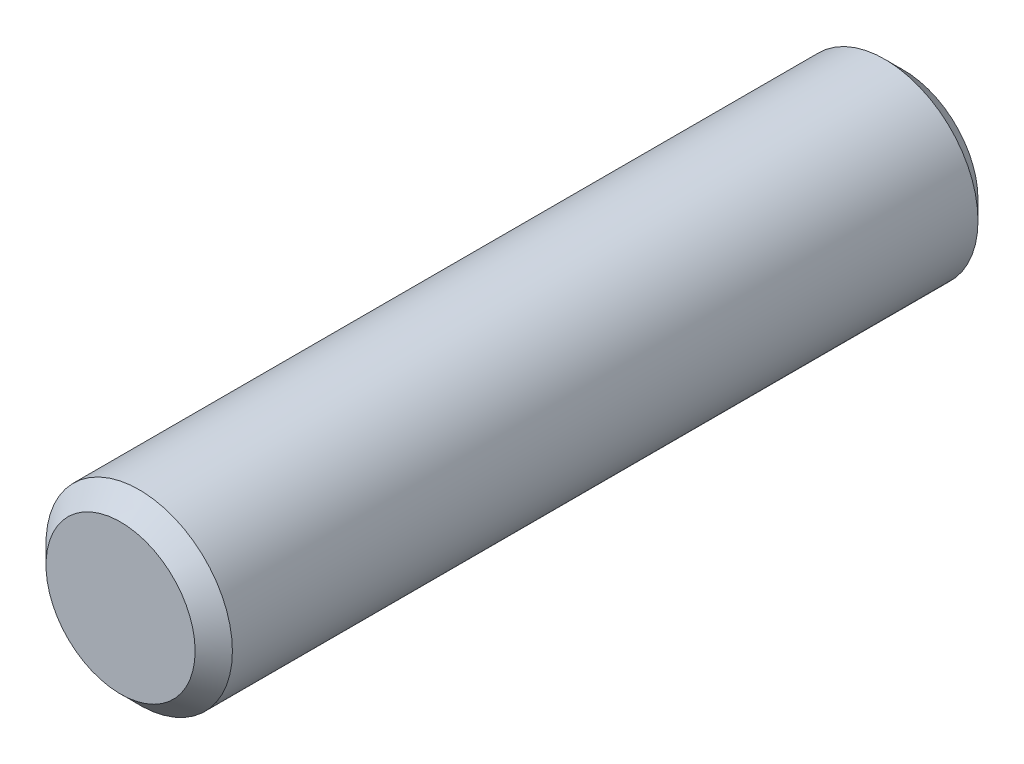
ISO-10303-21;
HEADER;
FILE_DESCRIPTION(('STEP AP214'),'2;1');
FILE_NAME('part.step','',(''),(''),'','','');
FILE_SCHEMA(('AUTOMOTIVE_DESIGN { 1 0 10303 214 1 1 1 1 }'));
ENDSEC;
DATA;
#1=APPLICATION_CONTEXT('core data for automotive mechanical design processes');
#2=APPLICATION_PROTOCOL_DEFINITION('international standard','automotive_design',2000,#1);
#3=PRODUCT_CONTEXT('',#1,'mechanical');
#4=PRODUCT('Part','Part','',(#3));
#5=PRODUCT_RELATED_PRODUCT_CATEGORY('part','',(#4));
#6=PRODUCT_DEFINITION_FORMATION('','',#4);
#7=PRODUCT_DEFINITION_CONTEXT('part definition',#1,'design');
#8=PRODUCT_DEFINITION('design','',#6,#7);
#9=PRODUCT_DEFINITION_SHAPE('','',#8);
#10=(LENGTH_UNIT() NAMED_UNIT(*) SI_UNIT(.MILLI.,.METRE.));
#11=(NAMED_UNIT(*) PLANE_ANGLE_UNIT() SI_UNIT($,.RADIAN.));
#12=(NAMED_UNIT(*) SI_UNIT($,.STERADIAN.) SOLID_ANGLE_UNIT());
#13=UNCERTAINTY_MEASURE_WITH_UNIT(LENGTH_MEASURE(1.E-05),#10,'distance_accuracy_value','');
#14=(GEOMETRIC_REPRESENTATION_CONTEXT(3) GLOBAL_UNCERTAINTY_ASSIGNED_CONTEXT((#13)) GLOBAL_UNIT_ASSIGNED_CONTEXT((#10,
#11,#12)) REPRESENTATION_CONTEXT('',''));
#15=CARTESIAN_POINT('',(0.,0.,0.));
#16=DIRECTION('',(0.,0.,1.));
#17=DIRECTION('',(1.,0.,0.));
#18=AXIS2_PLACEMENT_3D('',#15,#16,#17);
#19=CARTESIAN_POINT('',(0.,0.,84.));
#20=DIRECTION('',(0.,0.,-1.));
#21=DIRECTION('',(-1.,0.,0.));
#22=AXIS2_PLACEMENT_3D('',#19,#20,#21);
#23=CYLINDRICAL_SURFACE('',#22,10.);
#24=CARTESIAN_POINT('',(0.,0.,2.0000000000001));
#25=DIRECTION('',(0.,0.,1.));
#26=DIRECTION('',(1.,0.,0.));
#27=AXIS2_PLACEMENT_3D('',#24,#25,#26);
#28=CIRCLE('',#27,10.);
#29=CARTESIAN_POINT('',(10.,0.,2.0000000000001));
#30=VERTEX_POINT('',#29);
#31=EDGE_CURVE('E28',#30,#30,#28,.T.);
#32=ORIENTED_EDGE('',*,*,#31,.T.);
#33=EDGE_LOOP('',(#32));
#34=FACE_BOUND('',#33,.T.);
#35=CARTESIAN_POINT('',(0.,0.,82.0000000000001));
#36=DIRECTION('',(0.,0.,1.));
#37=DIRECTION('',(1.,0.,0.));
#38=AXIS2_PLACEMENT_3D('',#35,#36,#37);
#39=CIRCLE('',#38,10.);
#40=CARTESIAN_POINT('',(10.,0.,82.0000000000001));
#41=VERTEX_POINT('',#40);
#42=EDGE_CURVE('E34',#41,#41,#39,.F.);
#43=ORIENTED_EDGE('',*,*,#42,.T.);
#44=EDGE_LOOP('',(#43));
#45=FACE_BOUND('',#44,.T.);
#46=ADVANCED_FACE('F13',(#34,#45),#23,.T.);
#47=CARTESIAN_POINT('',(0.,0.,84.));
#48=DIRECTION('',(0.,0.,1.));
#49=DIRECTION('',(1.,0.,0.));
#50=AXIS2_PLACEMENT_3D('',#47,#48,#49);
#51=PLANE('',#50);
#52=CARTESIAN_POINT('',(0.,0.,84.));
#53=DIRECTION('',(0.,0.,1.));
#54=DIRECTION('',(1.,0.,0.));
#55=AXIS2_PLACEMENT_3D('',#52,#53,#54);
#56=CIRCLE('',#55,8.00000000000006);
#57=CARTESIAN_POINT('',(8.00000000000006,0.,84.));
#58=VERTEX_POINT('',#57);
#59=EDGE_CURVE('E9',#58,#58,#56,.T.);
#60=ORIENTED_EDGE('',*,*,#59,.T.);
#61=EDGE_LOOP('',(#60));
#62=FACE_BOUND('',#61,.T.);
#63=ADVANCED_FACE('F53',(#62),#51,.T.);
#64=CARTESIAN_POINT('',(0.,0.,0.));
#65=DIRECTION('',(0.,0.,1.));
#66=DIRECTION('',(1.,0.,0.));
#67=AXIS2_PLACEMENT_3D('',#64,#65,#66);
#68=PLANE('',#67);
#69=CARTESIAN_POINT('',(0.,0.,0.));
#70=DIRECTION('',(0.,0.,1.));
#71=DIRECTION('',(1.,0.,0.));
#72=AXIS2_PLACEMENT_3D('',#69,#70,#71);
#73=CIRCLE('',#72,7.99999999999988);
#74=CARTESIAN_POINT('',(7.99999999999988,0.,0.));
#75=VERTEX_POINT('',#74);
#76=EDGE_CURVE('E21',#75,#75,#73,.F.);
#77=ORIENTED_EDGE('',*,*,#76,.T.);
#78=EDGE_LOOP('',(#77));
#79=FACE_BOUND('',#78,.T.);
#80=ADVANCED_FACE('F50',(#79),#68,.F.);
#81=CARTESIAN_POINT('',(0.,0.,2.0000000000001));
#82=DIRECTION('',(0.,0.,1.));
#83=DIRECTION('',(1.,0.,0.));
#84=AXIS2_PLACEMENT_3D('',#81,#82,#83);
#85=CONICAL_SURFACE('',#84,10.,0.785398163397453);
#86=ORIENTED_EDGE('',*,*,#76,.F.);
#87=EDGE_LOOP('',(#86));
#88=FACE_BOUND('',#87,.T.);
#89=ORIENTED_EDGE('',*,*,#31,.F.);
#90=EDGE_LOOP('',(#89));
#91=FACE_BOUND('',#90,.T.);
#92=ADVANCED_FACE('F45',(#88,#91),#85,.T.);
#93=CARTESIAN_POINT('',(0.,0.,84.));
#94=DIRECTION('',(0.,0.,-1.));
#95=DIRECTION('',(-1.,0.,0.));
#96=AXIS2_PLACEMENT_3D('',#93,#94,#95);
#97=CONICAL_SURFACE('',#96,8.00000000000006,0.785398163397447);
#98=ORIENTED_EDGE('',*,*,#42,.F.);
#99=EDGE_LOOP('',(#98));
#100=FACE_BOUND('',#99,.T.);
#101=ORIENTED_EDGE('',*,*,#59,.F.);
#102=EDGE_LOOP('',(#101));
#103=FACE_BOUND('',#102,.T.);
#104=ADVANCED_FACE('F15',(#100,#103),#97,.T.);
#105=CLOSED_SHELL('',(#46,#63,#80,#92,#104));
#106=MANIFOLD_SOLID_BREP('B1',#105);
#107=ADVANCED_BREP_SHAPE_REPRESENTATION('',(#18,#106),#14);
#108=SHAPE_DEFINITION_REPRESENTATION(#9,#107);
ENDSEC;
END-ISO-10303-21;
